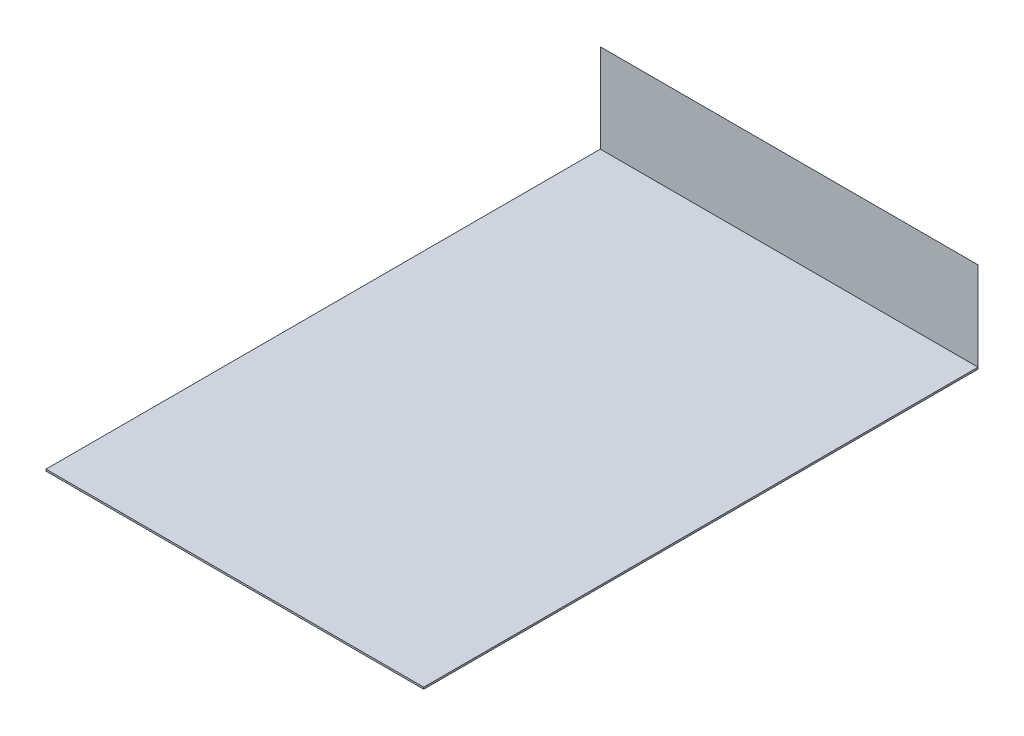
ISO-10303-21;
HEADER;
FILE_DESCRIPTION(('STEP AP214'),'2;1');
FILE_NAME('part.step','',(''),(''),'','','');
FILE_SCHEMA(('AUTOMOTIVE_DESIGN { 1 0 10303 214 1 1 1 1 }'));
ENDSEC;
DATA;
#1=APPLICATION_CONTEXT('core data for automotive mechanical design processes');
#2=APPLICATION_PROTOCOL_DEFINITION('international standard','automotive_design',2000,#1);
#3=PRODUCT_CONTEXT('',#1,'mechanical');
#4=PRODUCT('Part','Part','',(#3));
#5=PRODUCT_RELATED_PRODUCT_CATEGORY('part','',(#4));
#6=PRODUCT_DEFINITION_FORMATION('','',#4);
#7=PRODUCT_DEFINITION_CONTEXT('part definition',#1,'design');
#8=PRODUCT_DEFINITION('design','',#6,#7);
#9=PRODUCT_DEFINITION_SHAPE('','',#8);
#10=(LENGTH_UNIT() NAMED_UNIT(*) SI_UNIT(.MILLI.,.METRE.));
#11=(NAMED_UNIT(*) PLANE_ANGLE_UNIT() SI_UNIT($,.RADIAN.));
#12=(NAMED_UNIT(*) SI_UNIT($,.STERADIAN.) SOLID_ANGLE_UNIT());
#13=UNCERTAINTY_MEASURE_WITH_UNIT(LENGTH_MEASURE(1.E-05),#10,'distance_accuracy_value','');
#14=(GEOMETRIC_REPRESENTATION_CONTEXT(3) GLOBAL_UNCERTAINTY_ASSIGNED_CONTEXT((#13)) GLOBAL_UNIT_ASSIGNED_CONTEXT((#10,
#11,#12)) REPRESENTATION_CONTEXT('',''));
#15=CARTESIAN_POINT('',(0.,0.,0.));
#16=DIRECTION('',(0.,0.,1.));
#17=DIRECTION('',(1.,0.,0.));
#18=AXIS2_PLACEMENT_3D('',#15,#16,#17);
#19=CARTESIAN_POINT('',(-106.5,0.,-312.59));
#20=DIRECTION('',(0.,0.,1.));
#21=DIRECTION('',(1.,0.,0.));
#22=AXIS2_PLACEMENT_3D('',#19,#20,#21);
#23=PLANE('',#22);
#24=DIRECTION('',(1.,0.,0.));
#25=VECTOR('',#24,1.);
#26=CARTESIAN_POINT('',(-106.5,50.,-312.59));
#27=LINE('',#26,#25);
#28=CARTESIAN_POINT('',(-106.5,50.,-312.59));
#29=VERTEX_POINT('',#28);
#30=CARTESIAN_POINT('',(106.5,50.,-312.59));
#31=VERTEX_POINT('',#30);
#32=EDGE_CURVE('E63',#29,#31,#27,.T.);
#33=ORIENTED_EDGE('',*,*,#32,.F.);
#34=DIRECTION('',(0.,1.,0.));
#35=VECTOR('',#34,1.);
#36=CARTESIAN_POINT('',(-106.5,0.,-312.59));
#37=LINE('',#36,#35);
#38=CARTESIAN_POINT('',(-106.5,0.,-312.59));
#39=VERTEX_POINT('',#38);
#40=EDGE_CURVE('E45',#39,#29,#37,.T.);
#41=ORIENTED_EDGE('',*,*,#40,.F.);
#42=DIRECTION('',(1.,0.,0.));
#43=VECTOR('',#42,1.);
#44=CARTESIAN_POINT('',(-106.5,0.,-312.59));
#45=LINE('',#44,#43);
#46=CARTESIAN_POINT('',(106.5,0.,-312.59));
#47=VERTEX_POINT('',#46);
#48=EDGE_CURVE('E51',#39,#47,#45,.T.);
#49=ORIENTED_EDGE('',*,*,#48,.T.);
#50=DIRECTION('',(0.,1.,0.));
#51=VECTOR('',#50,1.);
#52=CARTESIAN_POINT('',(106.5,0.,-312.59));
#53=LINE('',#52,#51);
#54=EDGE_CURVE('E12',#47,#31,#53,.T.);
#55=ORIENTED_EDGE('',*,*,#54,.T.);
#56=EDGE_LOOP('',(#33,#41,#49,#55));
#57=FACE_BOUND('',#56,.T.);
#58=ADVANCED_FACE('F44',(#57),#23,.T.);
#59=OPEN_SHELL('',(#58));
#60=SHELL_BASED_SURFACE_MODEL('B2',(#59));
#61=CARTESIAN_POINT('',(106.5,-1.,-312.59));
#62=DIRECTION('',(1.,0.,0.));
#63=DIRECTION('',(0.,0.,-1.));
#64=AXIS2_PLACEMENT_3D('',#61,#62,#63);
#65=PLANE('',#64);
#66=DIRECTION('',(0.,0.,-1.));
#67=VECTOR('',#66,1.);
#68=CARTESIAN_POINT('',(106.5,0.,-312.59));
#69=LINE('',#68,#67);
#70=CARTESIAN_POINT('',(106.5,0.,0.));
#71=VERTEX_POINT('',#70);
#72=CARTESIAN_POINT('',(106.5,0.,-312.59));
#73=VERTEX_POINT('',#72);
#74=EDGE_CURVE('E151',#71,#73,#69,.T.);
#75=ORIENTED_EDGE('',*,*,#74,.F.);
#76=DIRECTION('',(0.,1.,0.));
#77=VECTOR('',#76,1.);
#78=CARTESIAN_POINT('',(106.5,-1.,0.));
#79=LINE('',#78,#77);
#80=CARTESIAN_POINT('',(106.5,-1.,0.));
#81=VERTEX_POINT('',#80);
#82=EDGE_CURVE('E42',#81,#71,#79,.T.);
#83=ORIENTED_EDGE('',*,*,#82,.F.);
#84=DIRECTION('',(0.,0.,-1.));
#85=VECTOR('',#84,1.);
#86=CARTESIAN_POINT('',(106.5,-1.,-312.59));
#87=LINE('',#86,#85);
#88=CARTESIAN_POINT('',(106.5,-1.,-312.59));
#89=VERTEX_POINT('',#88);
#90=EDGE_CURVE('E145',#81,#89,#87,.T.);
#91=ORIENTED_EDGE('',*,*,#90,.T.);
#92=DIRECTION('',(0.,1.,0.));
#93=VECTOR('',#92,1.);
#94=CARTESIAN_POINT('',(106.5,-1.,-312.59));
#95=LINE('',#94,#93);
#96=EDGE_CURVE('E90',#89,#73,#95,.T.);
#97=ORIENTED_EDGE('',*,*,#96,.T.);
#98=EDGE_LOOP('',(#75,#83,#91,#97));
#99=FACE_BOUND('',#98,.T.);
#100=ADVANCED_FACE('F87',(#99),#65,.T.);
#101=CARTESIAN_POINT('',(-106.5,-1.,0.));
#102=DIRECTION('',(0.,0.,1.));
#103=DIRECTION('',(1.,0.,0.));
#104=AXIS2_PLACEMENT_3D('',#101,#102,#103);
#105=PLANE('',#104);
#106=DIRECTION('',(1.,0.,0.));
#107=VECTOR('',#106,1.);
#108=CARTESIAN_POINT('',(-106.5,0.,0.));
#109=LINE('',#108,#107);
#110=CARTESIAN_POINT('',(-106.5,0.,0.));
#111=VERTEX_POINT('',#110);
#112=EDGE_CURVE('E147',#111,#71,#109,.T.);
#113=ORIENTED_EDGE('',*,*,#112,.F.);
#114=DIRECTION('',(0.,1.,0.));
#115=VECTOR('',#114,1.);
#116=CARTESIAN_POINT('',(-106.5,-1.,0.));
#117=LINE('',#116,#115);
#118=CARTESIAN_POINT('',(-106.5,-1.,0.));
#119=VERTEX_POINT('',#118);
#120=EDGE_CURVE('E96',#119,#111,#117,.T.);
#121=ORIENTED_EDGE('',*,*,#120,.F.);
#122=DIRECTION('',(1.,0.,0.));
#123=VECTOR('',#122,1.);
#124=CARTESIAN_POINT('',(-106.5,-1.,0.));
#125=LINE('',#124,#123);
#126=EDGE_CURVE('E142',#119,#81,#125,.T.);
#127=ORIENTED_EDGE('',*,*,#126,.T.);
#128=ORIENTED_EDGE('',*,*,#82,.T.);
#129=EDGE_LOOP('',(#113,#121,#127,#128));
#130=FACE_BOUND('',#129,.T.);
#131=ADVANCED_FACE('F161',(#130),#105,.T.);
#132=CARTESIAN_POINT('',(-106.5,-1.,-312.59));
#133=DIRECTION('',(-1.,0.,0.));
#134=DIRECTION('',(0.,0.,1.));
#135=AXIS2_PLACEMENT_3D('',#132,#133,#134);
#136=PLANE('',#135);
#137=DIRECTION('',(0.,0.,1.));
#138=VECTOR('',#137,1.);
#139=CARTESIAN_POINT('',(-106.5,0.,-312.59));
#140=LINE('',#139,#138);
#141=CARTESIAN_POINT('',(-106.5,0.,-312.59));
#142=VERTEX_POINT('',#141);
#143=EDGE_CURVE('E137',#142,#111,#140,.T.);
#144=ORIENTED_EDGE('',*,*,#143,.F.);
#145=DIRECTION('',(0.,1.,0.));
#146=VECTOR('',#145,1.);
#147=CARTESIAN_POINT('',(-106.5,-1.,-312.59));
#148=LINE('',#147,#146);
#149=CARTESIAN_POINT('',(-106.5,-1.,-312.59));
#150=VERTEX_POINT('',#149);
#151=EDGE_CURVE('E132',#150,#142,#148,.T.);
#152=ORIENTED_EDGE('',*,*,#151,.F.);
#153=DIRECTION('',(0.,0.,1.));
#154=VECTOR('',#153,1.);
#155=CARTESIAN_POINT('',(-106.5,-1.,-312.59));
#156=LINE('',#155,#154);
#157=EDGE_CURVE('E135',#150,#119,#156,.T.);
#158=ORIENTED_EDGE('',*,*,#157,.T.);
#159=ORIENTED_EDGE('',*,*,#120,.T.);
#160=EDGE_LOOP('',(#144,#152,#158,#159));
#161=FACE_BOUND('',#160,.T.);
#162=ADVANCED_FACE('F134',(#161),#136,.T.);
#163=CARTESIAN_POINT('',(-106.5,-1.,-312.59));
#164=DIRECTION('',(0.,0.,-1.));
#165=DIRECTION('',(-1.,0.,0.));
#166=AXIS2_PLACEMENT_3D('',#163,#164,#165);
#167=PLANE('',#166);
#168=DIRECTION('',(-1.,0.,0.));
#169=VECTOR('',#168,1.);
#170=CARTESIAN_POINT('',(-106.5,0.,-312.59));
#171=LINE('',#170,#169);
#172=EDGE_CURVE('E154',#73,#142,#171,.T.);
#173=ORIENTED_EDGE('',*,*,#172,.F.);
#174=ORIENTED_EDGE('',*,*,#96,.F.);
#175=DIRECTION('',(-1.,0.,0.));
#176=VECTOR('',#175,1.);
#177=CARTESIAN_POINT('',(-106.5,-1.,-312.59));
#178=LINE('',#177,#176);
#179=EDGE_CURVE('E141',#89,#150,#178,.T.);
#180=ORIENTED_EDGE('',*,*,#179,.T.);
#181=ORIENTED_EDGE('',*,*,#151,.T.);
#182=EDGE_LOOP('',(#173,#174,#180,#181));
#183=FACE_BOUND('',#182,.T.);
#184=ADVANCED_FACE('F144',(#183),#167,.T.);
#185=CARTESIAN_POINT('',(106.5,-1.,0.));
#186=DIRECTION('',(0.,1.,0.));
#187=DIRECTION('',(0.,0.,1.));
#188=AXIS2_PLACEMENT_3D('',#185,#186,#187);
#189=PLANE('',#188);
#190=ORIENTED_EDGE('',*,*,#90,.F.);
#191=ORIENTED_EDGE('',*,*,#126,.F.);
#192=ORIENTED_EDGE('',*,*,#157,.F.);
#193=ORIENTED_EDGE('',*,*,#179,.F.);
#194=EDGE_LOOP('',(#190,#191,#192,#193));
#195=FACE_BOUND('',#194,.T.);
#196=ADVANCED_FACE('F140',(#195),#189,.F.);
#197=CARTESIAN_POINT('',(106.5,0.,0.));
#198=DIRECTION('',(0.,1.,0.));
#199=DIRECTION('',(0.,0.,1.));
#200=AXIS2_PLACEMENT_3D('',#197,#198,#199);
#201=PLANE('',#200);
#202=ORIENTED_EDGE('',*,*,#74,.T.);
#203=ORIENTED_EDGE('',*,*,#172,.T.);
#204=ORIENTED_EDGE('',*,*,#143,.T.);
#205=ORIENTED_EDGE('',*,*,#112,.T.);
#206=EDGE_LOOP('',(#202,#203,#204,#205));
#207=FACE_BOUND('',#206,.T.);
#208=ADVANCED_FACE('F160',(#207),#201,.T.);
#209=CLOSED_SHELL('',(#100,#131,#162,#184,#196,#208));
#210=MANIFOLD_SOLID_BREP('B6',#209);
#211=ADVANCED_BREP_SHAPE_REPRESENTATION('',(#18,#210),#14);
#212=MANIFOLD_SURFACE_SHAPE_REPRESENTATION('',(#18,#60),#14);
#213=SHAPE_REPRESENTATION('',(#18),#14);
#214=SHAPE_DEFINITION_REPRESENTATION(#9,#213);
#215=SHAPE_REPRESENTATION_RELATIONSHIP('','',#213,#211);
#216=SHAPE_REPRESENTATION_RELATIONSHIP('','',#213,#212);
ENDSEC;
END-ISO-10303-21;
